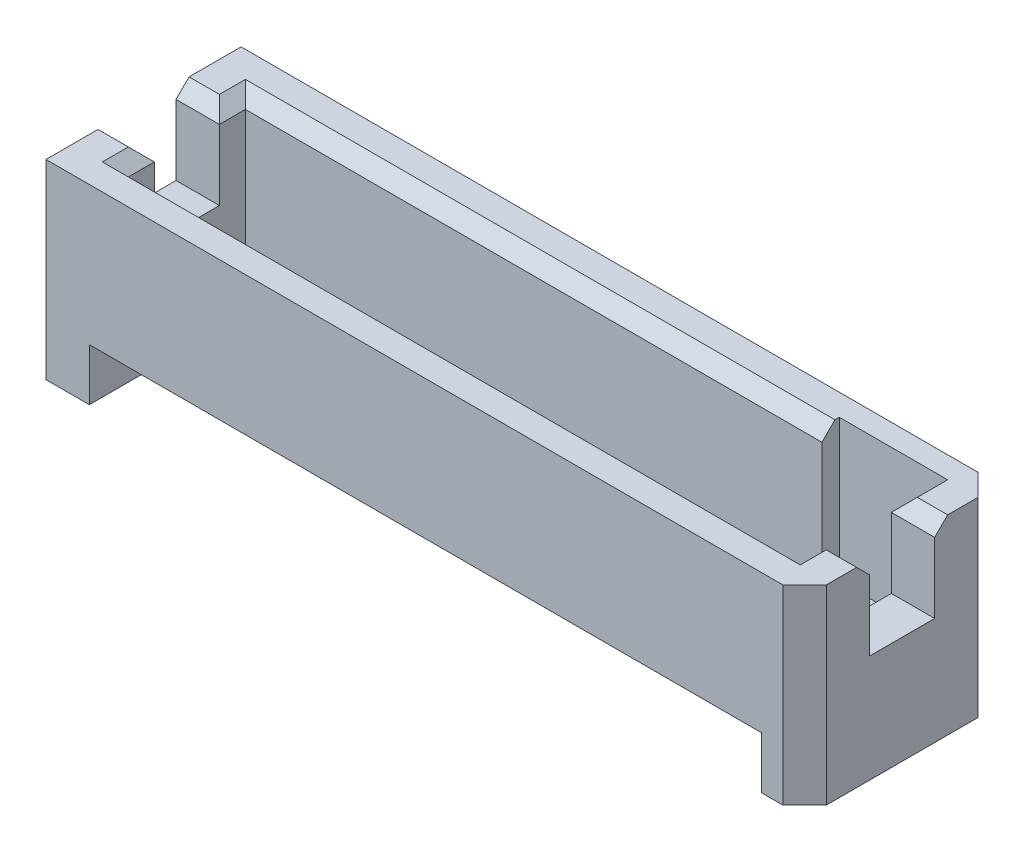
ISO-10303-21;
HEADER;
FILE_DESCRIPTION(('STEP AP214'),'2;1');
FILE_NAME('part.step','',(''),(''),'','','');
FILE_SCHEMA(('AUTOMOTIVE_DESIGN { 1 0 10303 214 1 1 1 1 }'));
ENDSEC;
DATA;
#1=APPLICATION_CONTEXT('core data for automotive mechanical design processes');
#2=APPLICATION_PROTOCOL_DEFINITION('international standard','automotive_design',2000,#1);
#3=PRODUCT_CONTEXT('',#1,'mechanical');
#4=PRODUCT('Part','Part','',(#3));
#5=PRODUCT_RELATED_PRODUCT_CATEGORY('part','',(#4));
#6=PRODUCT_DEFINITION_FORMATION('','',#4);
#7=PRODUCT_DEFINITION_CONTEXT('part definition',#1,'design');
#8=PRODUCT_DEFINITION('design','',#6,#7);
#9=PRODUCT_DEFINITION_SHAPE('','',#8);
#10=(LENGTH_UNIT() NAMED_UNIT(*) SI_UNIT(.MILLI.,.METRE.));
#11=(NAMED_UNIT(*) PLANE_ANGLE_UNIT() SI_UNIT($,.RADIAN.));
#12=(NAMED_UNIT(*) SI_UNIT($,.STERADIAN.) SOLID_ANGLE_UNIT());
#13=UNCERTAINTY_MEASURE_WITH_UNIT(LENGTH_MEASURE(1.E-05),#10,'distance_accuracy_value','');
#14=(GEOMETRIC_REPRESENTATION_CONTEXT(3) GLOBAL_UNCERTAINTY_ASSIGNED_CONTEXT((#13)) GLOBAL_UNIT_ASSIGNED_CONTEXT((#10,
#11,#12)) REPRESENTATION_CONTEXT('',''));
#15=CARTESIAN_POINT('',(0.,0.,0.));
#16=DIRECTION('',(0.,0.,1.));
#17=DIRECTION('',(1.,0.,0.));
#18=AXIS2_PLACEMENT_3D('',#15,#16,#17);
#19=CARTESIAN_POINT('',(10.4775,5.588,2.8575));
#20=DIRECTION('',(-0.707106781186546,0.,-0.707106781186549));
#21=DIRECTION('',(-0.707106781186549,0.,0.707106781186546));
#22=AXIS2_PLACEMENT_3D('',#19,#20,#21);
#23=PLANE('',#22);
#24=DIRECTION('',(0.707106781186549,0.,-0.707106781186546));
#25=VECTOR('',#24,1.);
#26=CARTESIAN_POINT('',(10.4775,0.,2.8575));
#27=LINE('',#26,#25);
#28=CARTESIAN_POINT('',(10.4775,0.,2.8575));
#29=VERTEX_POINT('',#28);
#30=CARTESIAN_POINT('',(11.1125,0.,2.2225));
#31=VERTEX_POINT('',#30);
#32=EDGE_CURVE('E11',#29,#31,#27,.T.);
#33=ORIENTED_EDGE('',*,*,#32,.T.);
#34=DIRECTION('',(0.,-1.,0.));
#35=VECTOR('',#34,1.);
#36=CARTESIAN_POINT('',(11.1125,5.588,2.2225));
#37=LINE('',#36,#35);
#38=CARTESIAN_POINT('',(11.1125,5.588,2.2225));
#39=VERTEX_POINT('',#38);
#40=EDGE_CURVE('E25',#39,#31,#37,.T.);
#41=ORIENTED_EDGE('',*,*,#40,.F.);
#42=DIRECTION('',(0.707106781186549,0.,-0.707106781186546));
#43=VECTOR('',#42,1.);
#44=CARTESIAN_POINT('',(10.4775,5.588,2.8575));
#45=LINE('',#44,#43);
#46=CARTESIAN_POINT('',(10.4775,5.588,2.8575));
#47=VERTEX_POINT('',#46);
#48=EDGE_CURVE('E661',#47,#39,#45,.T.);
#49=ORIENTED_EDGE('',*,*,#48,.F.);
#50=DIRECTION('',(0.,-1.,0.));
#51=VECTOR('',#50,1.);
#52=CARTESIAN_POINT('',(10.4775,5.588,2.8575));
#53=LINE('',#52,#51);
#54=EDGE_CURVE('E657',#47,#29,#53,.T.);
#55=ORIENTED_EDGE('',*,*,#54,.T.);
#56=EDGE_LOOP('',(#33,#41,#49,#55));
#57=FACE_BOUND('',#56,.T.);
#58=ADVANCED_FACE('F17',(#57),#23,.F.);
#59=CARTESIAN_POINT('',(-11.1125,5.588,2.8575));
#60=DIRECTION('',(0.,0.,-1.));
#61=DIRECTION('',(-1.,0.,0.));
#62=AXIS2_PLACEMENT_3D('',#59,#60,#61);
#63=PLANE('',#62);
#64=DIRECTION('',(-1.,0.,0.));
#65=VECTOR('',#64,1.);
#66=CARTESIAN_POINT('',(9.8425,1.524,2.8575));
#67=LINE('',#66,#65);
#68=CARTESIAN_POINT('',(9.8425,1.524,2.8575));
#69=VERTEX_POINT('',#68);
#70=CARTESIAN_POINT('',(-9.8425,1.524,2.8575));
#71=VERTEX_POINT('',#70);
#72=EDGE_CURVE('E652',#69,#71,#67,.T.);
#73=ORIENTED_EDGE('',*,*,#72,.F.);
#74=DIRECTION('',(0.,-1.,0.));
#75=VECTOR('',#74,1.);
#76=CARTESIAN_POINT('',(9.8425,1.524,2.8575));
#77=LINE('',#76,#75);
#78=CARTESIAN_POINT('',(9.8425,0.,2.8575));
#79=VERTEX_POINT('',#78);
#80=EDGE_CURVE('E648',#69,#79,#77,.T.);
#81=ORIENTED_EDGE('',*,*,#80,.T.);
#82=DIRECTION('',(1.,0.,0.));
#83=VECTOR('',#82,1.);
#84=CARTESIAN_POINT('',(-11.1125,0.,2.8575));
#85=LINE('',#84,#83);
#86=EDGE_CURVE('E643',#79,#29,#85,.T.);
#87=ORIENTED_EDGE('',*,*,#86,.T.);
#88=ORIENTED_EDGE('',*,*,#54,.F.);
#89=DIRECTION('',(1.,0.,0.));
#90=VECTOR('',#89,1.);
#91=CARTESIAN_POINT('',(-11.1125,5.588,2.8575));
#92=LINE('',#91,#90);
#93=CARTESIAN_POINT('',(-11.1125,5.588,2.8575));
#94=VERTEX_POINT('',#93);
#95=EDGE_CURVE('E638',#94,#47,#92,.T.);
#96=ORIENTED_EDGE('',*,*,#95,.F.);
#97=DIRECTION('',(0.,-1.,0.));
#98=VECTOR('',#97,1.);
#99=CARTESIAN_POINT('',(-11.1125,5.588,2.8575));
#100=LINE('',#99,#98);
#101=CARTESIAN_POINT('',(-11.1125,0.,2.8575));
#102=VERTEX_POINT('',#101);
#103=EDGE_CURVE('E634',#94,#102,#100,.T.);
#104=ORIENTED_EDGE('',*,*,#103,.T.);
#105=DIRECTION('',(1.,0.,0.));
#106=VECTOR('',#105,1.);
#107=CARTESIAN_POINT('',(-11.1125,0.,2.8575));
#108=LINE('',#107,#106);
#109=CARTESIAN_POINT('',(-9.8425,0.,2.8575));
#110=VERTEX_POINT('',#109);
#111=EDGE_CURVE('E630',#102,#110,#108,.T.);
#112=ORIENTED_EDGE('',*,*,#111,.T.);
#113=DIRECTION('',(0.,-1.,0.));
#114=VECTOR('',#113,1.);
#115=CARTESIAN_POINT('',(-9.8425,1.524,2.8575));
#116=LINE('',#115,#114);
#117=EDGE_CURVE('E625',#71,#110,#116,.T.);
#118=ORIENTED_EDGE('',*,*,#117,.F.);
#119=EDGE_LOOP('',(#73,#81,#87,#88,#96,#104,#112,#118));
#120=FACE_BOUND('',#119,.T.);
#121=ADVANCED_FACE('F677',(#120),#63,.F.);
#122=CARTESIAN_POINT('',(-9.8425,0.,0.));
#123=DIRECTION('',(1.,0.,0.));
#124=DIRECTION('',(0.,0.,-1.));
#125=AXIS2_PLACEMENT_3D('',#122,#123,#124);
#126=PLANE('',#125);
#127=DIRECTION('',(0.,0.496138938356834,0.868243142124459));
#128=VECTOR('',#127,1.);
#129=CARTESIAN_POINT('',(-9.8425,0.508,1.0795));
#130=LINE('',#129,#128);
#131=CARTESIAN_POINT('',(-9.8425,0.508,1.0795));
#132=VERTEX_POINT('',#131);
#133=EDGE_CURVE('E620',#132,#71,#130,.T.);
#134=ORIENTED_EDGE('',*,*,#133,.T.);
#135=ORIENTED_EDGE('',*,*,#117,.T.);
#136=DIRECTION('',(0.,0.,-1.));
#137=VECTOR('',#136,1.);
#138=CARTESIAN_POINT('',(-9.8425,0.,2.8575));
#139=LINE('',#138,#137);
#140=CARTESIAN_POINT('',(-9.8425,0.,-2.8575));
#141=VERTEX_POINT('',#140);
#142=EDGE_CURVE('E616',#110,#141,#139,.T.);
#143=ORIENTED_EDGE('',*,*,#142,.T.);
#144=DIRECTION('',(0.,1.,0.));
#145=VECTOR('',#144,1.);
#146=CARTESIAN_POINT('',(-9.8425,0.,-2.8575));
#147=LINE('',#146,#145);
#148=CARTESIAN_POINT('',(-9.8425,1.524,-2.8575));
#149=VERTEX_POINT('',#148);
#150=EDGE_CURVE('E612',#141,#149,#147,.T.);
#151=ORIENTED_EDGE('',*,*,#150,.T.);
#152=DIRECTION('',(0.,-0.496138938356834,0.868243142124459));
#153=VECTOR('',#152,1.);
#154=CARTESIAN_POINT('',(-9.8425,1.524,-2.8575));
#155=LINE('',#154,#153);
#156=CARTESIAN_POINT('',(-9.8425,0.508,-1.0795));
#157=VERTEX_POINT('',#156);
#158=EDGE_CURVE('E608',#149,#157,#155,.T.);
#159=ORIENTED_EDGE('',*,*,#158,.T.);
#160=DIRECTION('',(0.,0.,1.));
#161=VECTOR('',#160,1.);
#162=CARTESIAN_POINT('',(-9.8425,0.508,-1.0795));
#163=LINE('',#162,#161);
#164=EDGE_CURVE('E604',#157,#132,#163,.T.);
#165=ORIENTED_EDGE('',*,*,#164,.T.);
#166=EDGE_LOOP('',(#134,#135,#143,#151,#159,#165));
#167=FACE_BOUND('',#166,.T.);
#168=ADVANCED_FACE('F807',(#167),#126,.T.);
#169=CARTESIAN_POINT('',(9.8425,0.508,-1.0795));
#170=DIRECTION('',(0.,-1.,0.));
#171=DIRECTION('',(0.,0.,-1.));
#172=AXIS2_PLACEMENT_3D('',#169,#170,#171);
#173=PLANE('',#172);
#174=ORIENTED_EDGE('',*,*,#164,.F.);
#175=DIRECTION('',(-1.,0.,0.));
#176=VECTOR('',#175,1.);
#177=CARTESIAN_POINT('',(9.8425,0.508,-1.0795));
#178=LINE('',#177,#176);
#179=CARTESIAN_POINT('',(9.8425,0.508,-1.0795));
#180=VERTEX_POINT('',#179);
#181=EDGE_CURVE('E599',#180,#157,#178,.T.);
#182=ORIENTED_EDGE('',*,*,#181,.F.);
#183=DIRECTION('',(0.,0.,1.));
#184=VECTOR('',#183,1.);
#185=CARTESIAN_POINT('',(9.8425,0.508,-1.0795));
#186=LINE('',#185,#184);
#187=CARTESIAN_POINT('',(9.8425,0.508,1.0795));
#188=VERTEX_POINT('',#187);
#189=EDGE_CURVE('E595',#180,#188,#186,.T.);
#190=ORIENTED_EDGE('',*,*,#189,.T.);
#191=DIRECTION('',(-1.,0.,0.));
#192=VECTOR('',#191,1.);
#193=CARTESIAN_POINT('',(9.8425,0.508,1.0795));
#194=LINE('',#193,#192);
#195=EDGE_CURVE('E590',#188,#132,#194,.T.);
#196=ORIENTED_EDGE('',*,*,#195,.T.);
#197=EDGE_LOOP('',(#174,#182,#190,#196));
#198=FACE_BOUND('',#197,.T.);
#199=ADVANCED_FACE('F811',(#198),#173,.T.);
#200=CARTESIAN_POINT('',(9.8425,0.508,1.0795));
#201=DIRECTION('',(0.,-0.868243142124459,0.496138938356834));
#202=DIRECTION('',(0.,-0.496138938356834,-0.868243142124459));
#203=AXIS2_PLACEMENT_3D('',#200,#201,#202);
#204=PLANE('',#203);
#205=ORIENTED_EDGE('',*,*,#133,.F.);
#206=ORIENTED_EDGE('',*,*,#195,.F.);
#207=DIRECTION('',(0.,0.496138938356834,0.868243142124459));
#208=VECTOR('',#207,1.);
#209=CARTESIAN_POINT('',(9.8425,0.508,1.0795));
#210=LINE('',#209,#208);
#211=EDGE_CURVE('E585',#188,#69,#210,.T.);
#212=ORIENTED_EDGE('',*,*,#211,.T.);
#213=ORIENTED_EDGE('',*,*,#72,.T.);
#214=EDGE_LOOP('',(#205,#206,#212,#213));
#215=FACE_BOUND('',#214,.T.);
#216=ADVANCED_FACE('F817',(#215),#204,.T.);
#217=CARTESIAN_POINT('',(9.8425,0.,0.));
#218=DIRECTION('',(1.,0.,0.));
#219=DIRECTION('',(0.,0.,-1.));
#220=AXIS2_PLACEMENT_3D('',#217,#218,#219);
#221=PLANE('',#220);
#222=ORIENTED_EDGE('',*,*,#211,.F.);
#223=ORIENTED_EDGE('',*,*,#189,.F.);
#224=DIRECTION('',(0.,-0.496138938356834,0.868243142124459));
#225=VECTOR('',#224,1.);
#226=CARTESIAN_POINT('',(9.8425,1.524,-2.8575));
#227=LINE('',#226,#225);
#228=CARTESIAN_POINT('',(9.8425,1.524,-2.8575));
#229=VERTEX_POINT('',#228);
#230=EDGE_CURVE('E580',#229,#180,#227,.T.);
#231=ORIENTED_EDGE('',*,*,#230,.F.);
#232=DIRECTION('',(0.,1.,0.));
#233=VECTOR('',#232,1.);
#234=CARTESIAN_POINT('',(9.8425,0.,-2.8575));
#235=LINE('',#234,#233);
#236=CARTESIAN_POINT('',(9.8425,0.,-2.8575));
#237=VERTEX_POINT('',#236);
#238=EDGE_CURVE('E575',#237,#229,#235,.T.);
#239=ORIENTED_EDGE('',*,*,#238,.F.);
#240=DIRECTION('',(0.,0.,-1.));
#241=VECTOR('',#240,1.);
#242=CARTESIAN_POINT('',(9.8425,0.,2.8575));
#243=LINE('',#242,#241);
#244=EDGE_CURVE('E570',#79,#237,#243,.T.);
#245=ORIENTED_EDGE('',*,*,#244,.F.);
#246=ORIENTED_EDGE('',*,*,#80,.F.);
#247=EDGE_LOOP('',(#222,#223,#231,#239,#245,#246));
#248=FACE_BOUND('',#247,.T.);
#249=ADVANCED_FACE('F821',(#248),#221,.F.);
#250=CARTESIAN_POINT('',(0.,0.,0.));
#251=DIRECTION('',(0.,1.,0.));
#252=DIRECTION('',(0.,0.,1.));
#253=AXIS2_PLACEMENT_3D('',#250,#251,#252);
#254=PLANE('',#253);
#255=ORIENTED_EDGE('',*,*,#86,.F.);
#256=ORIENTED_EDGE('',*,*,#244,.T.);
#257=DIRECTION('',(-1.,0.,0.));
#258=VECTOR('',#257,1.);
#259=CARTESIAN_POINT('',(10.4775,0.,-2.8575));
#260=LINE('',#259,#258);
#261=CARTESIAN_POINT('',(10.4775,0.,-2.8575));
#262=VERTEX_POINT('',#261);
#263=EDGE_CURVE('E565',#262,#237,#260,.T.);
#264=ORIENTED_EDGE('',*,*,#263,.F.);
#265=DIRECTION('',(-0.707106781186549,0.,-0.707106781186546));
#266=VECTOR('',#265,1.);
#267=CARTESIAN_POINT('',(11.1125,0.,-2.2225));
#268=LINE('',#267,#266);
#269=CARTESIAN_POINT('',(11.1125,0.,-2.2225));
#270=VERTEX_POINT('',#269);
#271=EDGE_CURVE('E560',#270,#262,#268,.T.);
#272=ORIENTED_EDGE('',*,*,#271,.F.);
#273=DIRECTION('',(0.,0.,-1.));
#274=VECTOR('',#273,1.);
#275=CARTESIAN_POINT('',(11.1125,0.,2.2225));
#276=LINE('',#275,#274);
#277=EDGE_CURVE('E555',#31,#270,#276,.T.);
#278=ORIENTED_EDGE('',*,*,#277,.F.);
#279=ORIENTED_EDGE('',*,*,#32,.F.);
#280=EDGE_LOOP('',(#255,#256,#264,#272,#278,#279));
#281=FACE_BOUND('',#280,.T.);
#282=ADVANCED_FACE('F682',(#281),#254,.F.);
#283=CARTESIAN_POINT('',(11.1125,5.588,2.2225));
#284=DIRECTION('',(-1.,0.,0.));
#285=DIRECTION('',(0.,0.,1.));
#286=AXIS2_PLACEMENT_3D('',#283,#284,#285);
#287=PLANE('',#286);
#288=DIRECTION('',(0.,-0.707106781186548,-0.707106781186547));
#289=VECTOR('',#288,1.);
#290=CARTESIAN_POINT('',(11.1125,5.588,1.3335));
#291=LINE('',#290,#289);
#292=CARTESIAN_POINT('',(11.1125,5.588,1.3335));
#293=VERTEX_POINT('',#292);
#294=CARTESIAN_POINT('',(11.1125,5.207,0.9525));
#295=VERTEX_POINT('',#294);
#296=EDGE_CURVE('E550',#293,#295,#291,.T.);
#297=ORIENTED_EDGE('',*,*,#296,.F.);
#298=DIRECTION('',(0.,0.,-1.));
#299=VECTOR('',#298,1.);
#300=CARTESIAN_POINT('',(11.1125,5.588,2.2225));
#301=LINE('',#300,#299);
#302=EDGE_CURVE('E545',#39,#293,#301,.T.);
#303=ORIENTED_EDGE('',*,*,#302,.F.);
#304=ORIENTED_EDGE('',*,*,#40,.T.);
#305=ORIENTED_EDGE('',*,*,#277,.T.);
#306=DIRECTION('',(0.,-1.,0.));
#307=VECTOR('',#306,1.);
#308=CARTESIAN_POINT('',(11.1125,5.588,-2.2225));
#309=LINE('',#308,#307);
#310=CARTESIAN_POINT('',(11.1125,5.588,-2.2225));
#311=VERTEX_POINT('',#310);
#312=EDGE_CURVE('E540',#311,#270,#309,.T.);
#313=ORIENTED_EDGE('',*,*,#312,.F.);
#314=DIRECTION('',(0.,0.,-1.));
#315=VECTOR('',#314,1.);
#316=CARTESIAN_POINT('',(11.1125,5.588,2.2225));
#317=LINE('',#316,#315);
#318=CARTESIAN_POINT('',(11.1125,5.588,-1.3335));
#319=VERTEX_POINT('',#318);
#320=EDGE_CURVE('E535',#319,#311,#317,.T.);
#321=ORIENTED_EDGE('',*,*,#320,.F.);
#322=DIRECTION('',(0.,0.707106781186548,-0.707106781186547));
#323=VECTOR('',#322,1.);
#324=CARTESIAN_POINT('',(11.1125,5.207,-0.9525));
#325=LINE('',#324,#323);
#326=CARTESIAN_POINT('',(11.1125,5.207,-0.9525));
#327=VERTEX_POINT('',#326);
#328=EDGE_CURVE('E530',#327,#319,#325,.T.);
#329=ORIENTED_EDGE('',*,*,#328,.F.);
#330=DIRECTION('',(0.,-1.,0.));
#331=VECTOR('',#330,1.);
#332=CARTESIAN_POINT('',(11.1125,8.0264,-0.9525));
#333=LINE('',#332,#331);
#334=CARTESIAN_POINT('',(11.1125,3.1496,-0.9525));
#335=VERTEX_POINT('',#334);
#336=EDGE_CURVE('E526',#327,#335,#333,.T.);
#337=ORIENTED_EDGE('',*,*,#336,.T.);
#338=DIRECTION('',(0.,0.,-1.));
#339=VECTOR('',#338,1.);
#340=CARTESIAN_POINT('',(11.1125,3.1496,0.9525));
#341=LINE('',#340,#339);
#342=CARTESIAN_POINT('',(11.1125,3.1496,0.9525));
#343=VERTEX_POINT('',#342);
#344=EDGE_CURVE('E521',#343,#335,#341,.T.);
#345=ORIENTED_EDGE('',*,*,#344,.F.);
#346=DIRECTION('',(0.,-1.,0.));
#347=VECTOR('',#346,1.);
#348=CARTESIAN_POINT('',(11.1125,8.0264,0.9525));
#349=LINE('',#348,#347);
#350=EDGE_CURVE('E516',#295,#343,#349,.T.);
#351=ORIENTED_EDGE('',*,*,#350,.F.);
#352=EDGE_LOOP('',(#297,#303,#304,#305,#313,#321,#329,#337,#345,#351));
#353=FACE_BOUND('',#352,.T.);
#354=ADVANCED_FACE('F671',(#353),#287,.F.);
#355=CARTESIAN_POINT('',(-11.1125,8.0264,0.9525));
#356=DIRECTION('',(0.,0.,-1.));
#357=DIRECTION('',(-1.,0.,0.));
#358=AXIS2_PLACEMENT_3D('',#355,#356,#357);
#359=PLANE('',#358);
#360=DIRECTION('',(0.,-1.,0.));
#361=VECTOR('',#360,1.);
#362=CARTESIAN_POINT('',(9.8425,8.0264,0.9525));
#363=LINE('',#362,#361);
#364=CARTESIAN_POINT('',(9.8425,5.207,0.9525));
#365=VERTEX_POINT('',#364);
#366=CARTESIAN_POINT('',(9.8425,3.1496,0.9525));
#367=VERTEX_POINT('',#366);
#368=EDGE_CURVE('E511',#365,#367,#363,.T.);
#369=ORIENTED_EDGE('',*,*,#368,.F.);
#370=DIRECTION('',(-1.,0.,0.));
#371=VECTOR('',#370,1.);
#372=CARTESIAN_POINT('',(11.1125,5.207,0.9525));
#373=LINE('',#372,#371);
#374=EDGE_CURVE('E506',#295,#365,#373,.T.);
#375=ORIENTED_EDGE('',*,*,#374,.F.);
#376=ORIENTED_EDGE('',*,*,#350,.T.);
#377=DIRECTION('',(1.,0.,0.));
#378=VECTOR('',#377,1.);
#379=CARTESIAN_POINT('',(-11.1125,3.1496,0.9525));
#380=LINE('',#379,#378);
#381=EDGE_CURVE('E501',#367,#343,#380,.T.);
#382=ORIENTED_EDGE('',*,*,#381,.F.);
#383=EDGE_LOOP('',(#369,#375,#376,#382));
#384=FACE_BOUND('',#383,.T.);
#385=ADVANCED_FACE('F791',(#384),#359,.T.);
#386=CARTESIAN_POINT('',(0.,3.1496,0.));
#387=DIRECTION('',(0.,1.,0.));
#388=DIRECTION('',(0.,0.,1.));
#389=AXIS2_PLACEMENT_3D('',#386,#387,#388);
#390=PLANE('',#389);
#391=DIRECTION('',(0.,0.,-1.));
#392=VECTOR('',#391,1.);
#393=CARTESIAN_POINT('',(9.8425,3.1496,0.));
#394=LINE('',#393,#392);
#395=CARTESIAN_POINT('',(9.8425,3.1496,-0.9525));
#396=VERTEX_POINT('',#395);
#397=EDGE_CURVE('E496',#367,#396,#394,.T.);
#398=ORIENTED_EDGE('',*,*,#397,.F.);
#399=ORIENTED_EDGE('',*,*,#381,.T.);
#400=ORIENTED_EDGE('',*,*,#344,.T.);
#401=DIRECTION('',(-1.,0.,0.));
#402=VECTOR('',#401,1.);
#403=CARTESIAN_POINT('',(11.1125,3.1496,-0.9525));
#404=LINE('',#403,#402);
#405=EDGE_CURVE('E492',#335,#396,#404,.T.);
#406=ORIENTED_EDGE('',*,*,#405,.T.);
#407=EDGE_LOOP('',(#398,#399,#400,#406));
#408=FACE_BOUND('',#407,.T.);
#409=ADVANCED_FACE('F793',(#408),#390,.T.);
#410=CARTESIAN_POINT('',(11.1125,8.0264,-0.9525));
#411=DIRECTION('',(0.,0.,1.));
#412=DIRECTION('',(1.,0.,0.));
#413=AXIS2_PLACEMENT_3D('',#410,#411,#412);
#414=PLANE('',#413);
#415=ORIENTED_EDGE('',*,*,#336,.F.);
#416=DIRECTION('',(-1.,0.,0.));
#417=VECTOR('',#416,1.);
#418=CARTESIAN_POINT('',(11.1125,5.207,-0.9525));
#419=LINE('',#418,#417);
#420=CARTESIAN_POINT('',(9.8425,5.207,-0.9525));
#421=VERTEX_POINT('',#420);
#422=EDGE_CURVE('E488',#327,#421,#419,.T.);
#423=ORIENTED_EDGE('',*,*,#422,.T.);
#424=DIRECTION('',(0.,1.,0.));
#425=VECTOR('',#424,1.);
#426=CARTESIAN_POINT('',(9.8425,8.0264,-0.9525));
#427=LINE('',#426,#425);
#428=EDGE_CURVE('E483',#396,#421,#427,.T.);
#429=ORIENTED_EDGE('',*,*,#428,.F.);
#430=ORIENTED_EDGE('',*,*,#405,.F.);
#431=EDGE_LOOP('',(#415,#423,#429,#430));
#432=FACE_BOUND('',#431,.T.);
#433=ADVANCED_FACE('F698',(#432),#414,.T.);
#434=CARTESIAN_POINT('',(9.8425,1.4351,1.7145));
#435=DIRECTION('',(1.,0.,0.));
#436=DIRECTION('',(0.,0.,-1.));
#437=AXIS2_PLACEMENT_3D('',#434,#435,#436);
#438=PLANE('',#437);
#439=ORIENTED_EDGE('',*,*,#397,.T.);
#440=ORIENTED_EDGE('',*,*,#428,.T.);
#441=DIRECTION('',(0.,0.,-1.));
#442=VECTOR('',#441,1.);
#443=CARTESIAN_POINT('',(9.8425,5.207,1.7145));
#444=LINE('',#443,#442);
#445=CARTESIAN_POINT('',(9.8425,5.207,-2.2225));
#446=VERTEX_POINT('',#445);
#447=EDGE_CURVE('E479',#421,#446,#444,.T.);
#448=ORIENTED_EDGE('',*,*,#447,.T.);
#449=DIRECTION('',(0.,1.,0.));
#450=VECTOR('',#449,1.);
#451=CARTESIAN_POINT('',(9.8425,1.4351,-2.2225));
#452=LINE('',#451,#450);
#453=CARTESIAN_POINT('',(9.8425,1.4351,-2.2225));
#454=VERTEX_POINT('',#453);
#455=EDGE_CURVE('E475',#454,#446,#452,.T.);
#456=ORIENTED_EDGE('',*,*,#455,.F.);
#457=DIRECTION('',(0.,0.,-1.));
#458=VECTOR('',#457,1.);
#459=CARTESIAN_POINT('',(9.8425,1.4351,1.7145));
#460=LINE('',#459,#458);
#461=CARTESIAN_POINT('',(9.8425,1.4351,1.7145));
#462=VERTEX_POINT('',#461);
#463=EDGE_CURVE('E233',#462,#454,#460,.T.);
#464=ORIENTED_EDGE('',*,*,#463,.F.);
#465=DIRECTION('',(0.,1.,0.));
#466=VECTOR('',#465,1.);
#467=CARTESIAN_POINT('',(9.8425,1.4351,1.7145));
#468=LINE('',#467,#466);
#469=CARTESIAN_POINT('',(9.8425,5.207,1.7145));
#470=VERTEX_POINT('',#469);
#471=EDGE_CURVE('E468',#462,#470,#468,.T.);
#472=ORIENTED_EDGE('',*,*,#471,.T.);
#473=DIRECTION('',(0.,0.,-1.));
#474=VECTOR('',#473,1.);
#475=CARTESIAN_POINT('',(9.8425,5.207,1.7145));
#476=LINE('',#475,#474);
#477=EDGE_CURVE('E463',#470,#365,#476,.T.);
#478=ORIENTED_EDGE('',*,*,#477,.T.);
#479=ORIENTED_EDGE('',*,*,#368,.T.);
#480=EDGE_LOOP('',(#439,#440,#448,#456,#464,#472,#478,#479));
#481=FACE_BOUND('',#480,.T.);
#482=ADVANCED_FACE('F702',(#481),#438,.F.);
#483=CARTESIAN_POINT('',(9.8425,5.207,1.7145));
#484=DIRECTION('',(-0.707106781186548,0.707106781186548,0.));
#485=DIRECTION('',(-0.707106781186548,-0.707106781186548,0.));
#486=AXIS2_PLACEMENT_3D('',#483,#484,#485);
#487=PLANE('',#486);
#488=DIRECTION('',(0.,0.,-1.));
#489=VECTOR('',#488,1.);
#490=CARTESIAN_POINT('',(10.2235,5.588,1.7145));
#491=LINE('',#490,#489);
#492=CARTESIAN_POINT('',(10.2235,5.588,2.0955));
#493=VERTEX_POINT('',#492);
#494=CARTESIAN_POINT('',(10.2235,5.588,1.3335));
#495=VERTEX_POINT('',#494);
#496=EDGE_CURVE('E459',#493,#495,#491,.T.);
#497=ORIENTED_EDGE('',*,*,#496,.T.);
#498=DIRECTION('',(-0.577350269189626,-0.577350269189626,-0.577350269189625));
#499=VECTOR('',#498,1.);
#500=CARTESIAN_POINT('',(10.0965,5.461,1.2065));
#501=LINE('',#500,#499);
#502=EDGE_CURVE('E454',#495,#365,#501,.T.);
#503=ORIENTED_EDGE('',*,*,#502,.T.);
#504=ORIENTED_EDGE('',*,*,#477,.F.);
#505=DIRECTION('',(-0.577350269189626,-0.577350269189626,-0.577350269189626));
#506=VECTOR('',#505,1.);
#507=CARTESIAN_POINT('',(9.8425,5.207,1.7145));
#508=LINE('',#507,#506);
#509=EDGE_CURVE('E449',#493,#470,#508,.T.);
#510=ORIENTED_EDGE('',*,*,#509,.F.);
#511=EDGE_LOOP('',(#497,#503,#504,#510));
#512=FACE_BOUND('',#511,.T.);
#513=ADVANCED_FACE('F788',(#512),#487,.T.);
#514=CARTESIAN_POINT('',(-9.8425,5.207,1.7145));
#515=DIRECTION('',(0.,0.707106781186548,-0.707106781186548));
#516=DIRECTION('',(0.,0.707106781186548,0.707106781186548));
#517=AXIS2_PLACEMENT_3D('',#514,#515,#516);
#518=PLANE('',#517);
#519=DIRECTION('',(1.,0.,0.));
#520=VECTOR('',#519,1.);
#521=CARTESIAN_POINT('',(-9.8425,5.207,1.7145));
#522=LINE('',#521,#520);
#523=CARTESIAN_POINT('',(-9.8425,5.207,1.7145));
#524=VERTEX_POINT('',#523);
#525=EDGE_CURVE('E444',#524,#470,#522,.T.);
#526=ORIENTED_EDGE('',*,*,#525,.F.);
#527=DIRECTION('',(0.577350269189626,-0.577350269189626,-0.577350269189626));
#528=VECTOR('',#527,1.);
#529=CARTESIAN_POINT('',(-9.8425,5.207,1.7145));
#530=LINE('',#529,#528);
#531=CARTESIAN_POINT('',(-10.2235,5.588,2.0955));
#532=VERTEX_POINT('',#531);
#533=EDGE_CURVE('E439',#532,#524,#530,.T.);
#534=ORIENTED_EDGE('',*,*,#533,.F.);
#535=DIRECTION('',(1.,0.,0.));
#536=VECTOR('',#535,1.);
#537=CARTESIAN_POINT('',(-9.8425,5.588,2.0955));
#538=LINE('',#537,#536);
#539=EDGE_CURVE('E434',#532,#493,#538,.T.);
#540=ORIENTED_EDGE('',*,*,#539,.T.);
#541=ORIENTED_EDGE('',*,*,#509,.T.);
#542=EDGE_LOOP('',(#526,#534,#540,#541));
#543=FACE_BOUND('',#542,.T.);
#544=ADVANCED_FACE('F714',(#543),#518,.T.);
#545=CARTESIAN_POINT('',(0.,5.588,0.));
#546=DIRECTION('',(0.,1.,0.));
#547=DIRECTION('',(0.,0.,1.));
#548=AXIS2_PLACEMENT_3D('',#545,#546,#547);
#549=PLANE('',#548);
#550=ORIENTED_EDGE('',*,*,#302,.T.);
#551=DIRECTION('',(-1.,0.,0.));
#552=VECTOR('',#551,1.);
#553=CARTESIAN_POINT('',(11.1125,5.588,1.3335));
#554=LINE('',#553,#552);
#555=EDGE_CURVE('E429',#293,#495,#554,.T.);
#556=ORIENTED_EDGE('',*,*,#555,.T.);
#557=ORIENTED_EDGE('',*,*,#496,.F.);
#558=ORIENTED_EDGE('',*,*,#539,.F.);
#559=DIRECTION('',(0.,0.,1.));
#560=VECTOR('',#559,1.);
#561=CARTESIAN_POINT('',(-10.2235,5.588,-1.7145));
#562=LINE('',#561,#560);
#563=CARTESIAN_POINT('',(-10.2235,5.588,1.3335));
#564=VERTEX_POINT('',#563);
#565=EDGE_CURVE('E424',#564,#532,#562,.T.);
#566=ORIENTED_EDGE('',*,*,#565,.F.);
#567=DIRECTION('',(-1.,0.,0.));
#568=VECTOR('',#567,1.);
#569=CARTESIAN_POINT('',(11.1125,5.588,1.3335));
#570=LINE('',#569,#568);
#571=CARTESIAN_POINT('',(-11.1125,5.588,1.3335));
#572=VERTEX_POINT('',#571);
#573=EDGE_CURVE('E420',#564,#572,#570,.T.);
#574=ORIENTED_EDGE('',*,*,#573,.T.);
#575=DIRECTION('',(0.,0.,1.));
#576=VECTOR('',#575,1.);
#577=CARTESIAN_POINT('',(-11.1125,5.588,-2.8575));
#578=LINE('',#577,#576);
#579=EDGE_CURVE('E415',#572,#94,#578,.T.);
#580=ORIENTED_EDGE('',*,*,#579,.T.);
#581=ORIENTED_EDGE('',*,*,#95,.T.);
#582=ORIENTED_EDGE('',*,*,#48,.T.);
#583=EDGE_LOOP('',(#550,#556,#557,#558,#566,#574,#580,#581,#582));
#584=FACE_BOUND('',#583,.T.);
#585=ADVANCED_FACE('F674',(#584),#549,.T.);
#586=CARTESIAN_POINT('',(-11.1125,5.588,-2.8575));
#587=DIRECTION('',(1.,0.,0.));
#588=DIRECTION('',(0.,0.,-1.));
#589=AXIS2_PLACEMENT_3D('',#586,#587,#588);
#590=PLANE('',#589);
#591=DIRECTION('',(0.,-0.707106781186548,-0.707106781186547));
#592=VECTOR('',#591,1.);
#593=CARTESIAN_POINT('',(-11.1125,5.588,1.3335));
#594=LINE('',#593,#592);
#595=CARTESIAN_POINT('',(-11.1125,5.207,0.9525));
#596=VERTEX_POINT('',#595);
#597=EDGE_CURVE('E411',#572,#596,#594,.T.);
#598=ORIENTED_EDGE('',*,*,#597,.T.);
#599=DIRECTION('',(0.,-1.,0.));
#600=VECTOR('',#599,1.);
#601=CARTESIAN_POINT('',(-11.1125,8.0264,0.9525));
#602=LINE('',#601,#600);
#603=CARTESIAN_POINT('',(-11.1125,3.1496,0.9525));
#604=VERTEX_POINT('',#603);
#605=EDGE_CURVE('E407',#596,#604,#602,.T.);
#606=ORIENTED_EDGE('',*,*,#605,.T.);
#607=DIRECTION('',(0.,0.,1.));
#608=VECTOR('',#607,1.);
#609=CARTESIAN_POINT('',(-11.1125,3.1496,-0.9525));
#610=LINE('',#609,#608);
#611=CARTESIAN_POINT('',(-11.1125,3.1496,-0.9525));
#612=VERTEX_POINT('',#611);
#613=EDGE_CURVE('E402',#612,#604,#610,.T.);
#614=ORIENTED_EDGE('',*,*,#613,.F.);
#615=DIRECTION('',(0.,-1.,0.));
#616=VECTOR('',#615,1.);
#617=CARTESIAN_POINT('',(-11.1125,8.0264,-0.9525));
#618=LINE('',#617,#616);
#619=CARTESIAN_POINT('',(-11.1125,5.207,-0.9525));
#620=VERTEX_POINT('',#619);
#621=EDGE_CURVE('E397',#620,#612,#618,.T.);
#622=ORIENTED_EDGE('',*,*,#621,.F.);
#623=DIRECTION('',(0.,0.707106781186548,-0.707106781186547));
#624=VECTOR('',#623,1.);
#625=CARTESIAN_POINT('',(-11.1125,5.207,-0.9525));
#626=LINE('',#625,#624);
#627=CARTESIAN_POINT('',(-11.1125,5.588,-1.3335));
#628=VERTEX_POINT('',#627);
#629=EDGE_CURVE('E393',#620,#628,#626,.T.);
#630=ORIENTED_EDGE('',*,*,#629,.T.);
#631=DIRECTION('',(0.,0.,1.));
#632=VECTOR('',#631,1.);
#633=CARTESIAN_POINT('',(-11.1125,5.588,-2.8575));
#634=LINE('',#633,#632);
#635=CARTESIAN_POINT('',(-11.1125,5.588,-2.8575));
#636=VERTEX_POINT('',#635);
#637=EDGE_CURVE('E388',#636,#628,#634,.T.);
#638=ORIENTED_EDGE('',*,*,#637,.F.);
#639=DIRECTION('',(0.,-1.,0.));
#640=VECTOR('',#639,1.);
#641=CARTESIAN_POINT('',(-11.1125,5.588,-2.8575));
#642=LINE('',#641,#640);
#643=CARTESIAN_POINT('',(-11.1125,0.,-2.8575));
#644=VERTEX_POINT('',#643);
#645=EDGE_CURVE('E384',#636,#644,#642,.T.);
#646=ORIENTED_EDGE('',*,*,#645,.T.);
#647=DIRECTION('',(0.,0.,1.));
#648=VECTOR('',#647,1.);
#649=CARTESIAN_POINT('',(-11.1125,0.,-2.8575));
#650=LINE('',#649,#648);
#651=EDGE_CURVE('E379',#644,#102,#650,.T.);
#652=ORIENTED_EDGE('',*,*,#651,.T.);
#653=ORIENTED_EDGE('',*,*,#103,.F.);
#654=ORIENTED_EDGE('',*,*,#579,.F.);
#655=EDGE_LOOP('',(#598,#606,#614,#622,#630,#638,#646,#652,#653,#654));
#656=FACE_BOUND('',#655,.T.);
#657=ADVANCED_FACE('F782',(#656),#590,.F.);
#658=CARTESIAN_POINT('',(0.,0.,0.));
#659=DIRECTION('',(0.,1.,0.));
#660=DIRECTION('',(0.,0.,1.));
#661=AXIS2_PLACEMENT_3D('',#658,#659,#660);
#662=PLANE('',#661);
#663=ORIENTED_EDGE('',*,*,#142,.F.);
#664=ORIENTED_EDGE('',*,*,#111,.F.);
#665=ORIENTED_EDGE('',*,*,#651,.F.);
#666=DIRECTION('',(-1.,0.,0.));
#667=VECTOR('',#666,1.);
#668=CARTESIAN_POINT('',(10.4775,0.,-2.8575));
#669=LINE('',#668,#667);
#670=EDGE_CURVE('E374',#141,#644,#669,.T.);
#671=ORIENTED_EDGE('',*,*,#670,.F.);
#672=EDGE_LOOP('',(#663,#664,#665,#671));
#673=FACE_BOUND('',#672,.T.);
#674=ADVANCED_FACE('F892',(#673),#662,.F.);
#675=CARTESIAN_POINT('',(10.4775,5.588,-2.8575));
#676=DIRECTION('',(0.,0.,1.));
#677=DIRECTION('',(1.,0.,0.));
#678=AXIS2_PLACEMENT_3D('',#675,#676,#677);
#679=PLANE('',#678);
#680=ORIENTED_EDGE('',*,*,#263,.T.);
#681=ORIENTED_EDGE('',*,*,#238,.T.);
#682=DIRECTION('',(-1.,0.,0.));
#683=VECTOR('',#682,1.);
#684=CARTESIAN_POINT('',(9.8425,1.524,-2.8575));
#685=LINE('',#684,#683);
#686=EDGE_CURVE('E369',#229,#149,#685,.T.);
#687=ORIENTED_EDGE('',*,*,#686,.T.);
#688=ORIENTED_EDGE('',*,*,#150,.F.);
#689=ORIENTED_EDGE('',*,*,#670,.T.);
#690=ORIENTED_EDGE('',*,*,#645,.F.);
#691=DIRECTION('',(-1.,0.,0.));
#692=VECTOR('',#691,1.);
#693=CARTESIAN_POINT('',(10.4775,5.588,-2.8575));
#694=LINE('',#693,#692);
#695=CARTESIAN_POINT('',(10.4775,5.588,-2.8575));
#696=VERTEX_POINT('',#695);
#697=EDGE_CURVE('E364',#696,#636,#694,.T.);
#698=ORIENTED_EDGE('',*,*,#697,.F.);
#699=DIRECTION('',(0.,-1.,0.));
#700=VECTOR('',#699,1.);
#701=CARTESIAN_POINT('',(10.4775,5.588,-2.8575));
#702=LINE('',#701,#700);
#703=EDGE_CURVE('E359',#696,#262,#702,.T.);
#704=ORIENTED_EDGE('',*,*,#703,.T.);
#705=EDGE_LOOP('',(#680,#681,#687,#688,#689,#690,#698,#704));
#706=FACE_BOUND('',#705,.T.);
#707=ADVANCED_FACE('F901',(#706),#679,.F.);
#708=CARTESIAN_POINT('',(11.1125,5.588,-2.2225));
#709=DIRECTION('',(-0.707106781186546,0.,0.707106781186549));
#710=DIRECTION('',(0.707106781186549,0.,0.707106781186546));
#711=AXIS2_PLACEMENT_3D('',#708,#709,#710);
#712=PLANE('',#711);
#713=ORIENTED_EDGE('',*,*,#271,.T.);
#714=ORIENTED_EDGE('',*,*,#703,.F.);
#715=DIRECTION('',(-0.707106781186549,0.,-0.707106781186546));
#716=VECTOR('',#715,1.);
#717=CARTESIAN_POINT('',(11.1125,5.588,-2.2225));
#718=LINE('',#717,#716);
#719=EDGE_CURVE('E354',#311,#696,#718,.T.);
#720=ORIENTED_EDGE('',*,*,#719,.F.);
#721=ORIENTED_EDGE('',*,*,#312,.T.);
#722=EDGE_LOOP('',(#713,#714,#720,#721));
#723=FACE_BOUND('',#722,.T.);
#724=ADVANCED_FACE('F685',(#723),#712,.F.);
#725=CARTESIAN_POINT('',(0.,5.588,0.));
#726=DIRECTION('',(0.,1.,0.));
#727=DIRECTION('',(0.,0.,1.));
#728=AXIS2_PLACEMENT_3D('',#725,#726,#727);
#729=PLANE('',#728);
#730=DIRECTION('',(0.,0.,1.));
#731=VECTOR('',#730,1.);
#732=CARTESIAN_POINT('',(7.0485,5.588,-2.2225));
#733=LINE('',#732,#731);
#734=CARTESIAN_POINT('',(7.0485,5.588,-2.2225));
#735=VERTEX_POINT('',#734);
#736=CARTESIAN_POINT('',(7.0485,5.588,-2.0955));
#737=VERTEX_POINT('',#736);
#738=EDGE_CURVE('E350',#735,#737,#733,.T.);
#739=ORIENTED_EDGE('',*,*,#738,.F.);
#740=DIRECTION('',(-1.,0.,0.));
#741=VECTOR('',#740,1.);
#742=CARTESIAN_POINT('',(10.2235,5.588,-2.2225));
#743=LINE('',#742,#741);
#744=CARTESIAN_POINT('',(10.2235,5.588,-2.2225));
#745=VERTEX_POINT('',#744);
#746=EDGE_CURVE('E252',#745,#735,#743,.T.);
#747=ORIENTED_EDGE('',*,*,#746,.F.);
#748=DIRECTION('',(0.,0.,-1.));
#749=VECTOR('',#748,1.);
#750=CARTESIAN_POINT('',(10.2235,5.588,1.7145));
#751=LINE('',#750,#749);
#752=CARTESIAN_POINT('',(10.2235,5.588,-1.3335));
#753=VERTEX_POINT('',#752);
#754=EDGE_CURVE('E342',#753,#745,#751,.T.);
#755=ORIENTED_EDGE('',*,*,#754,.F.);
#756=DIRECTION('',(-1.,0.,0.));
#757=VECTOR('',#756,1.);
#758=CARTESIAN_POINT('',(11.1125,5.588,-1.3335));
#759=LINE('',#758,#757);
#760=EDGE_CURVE('E337',#319,#753,#759,.T.);
#761=ORIENTED_EDGE('',*,*,#760,.F.);
#762=ORIENTED_EDGE('',*,*,#320,.T.);
#763=ORIENTED_EDGE('',*,*,#719,.T.);
#764=ORIENTED_EDGE('',*,*,#697,.T.);
#765=ORIENTED_EDGE('',*,*,#637,.T.);
#766=DIRECTION('',(-1.,0.,0.));
#767=VECTOR('',#766,1.);
#768=CARTESIAN_POINT('',(11.1125,5.588,-1.3335));
#769=LINE('',#768,#767);
#770=CARTESIAN_POINT('',(-10.2235,5.588,-1.3335));
#771=VERTEX_POINT('',#770);
#772=EDGE_CURVE('E332',#771,#628,#769,.T.);
#773=ORIENTED_EDGE('',*,*,#772,.F.);
#774=DIRECTION('',(0.,0.,1.));
#775=VECTOR('',#774,1.);
#776=CARTESIAN_POINT('',(-10.2235,5.588,-1.7145));
#777=LINE('',#776,#775);
#778=CARTESIAN_POINT('',(-10.2235,5.588,-2.0955));
#779=VERTEX_POINT('',#778);
#780=EDGE_CURVE('E327',#779,#771,#777,.T.);
#781=ORIENTED_EDGE('',*,*,#780,.F.);
#782=DIRECTION('',(-1.,0.,0.));
#783=VECTOR('',#782,1.);
#784=CARTESIAN_POINT('',(9.8425,5.588,-2.0955));
#785=LINE('',#784,#783);
#786=EDGE_CURVE('E322',#737,#779,#785,.T.);
#787=ORIENTED_EDGE('',*,*,#786,.F.);
#788=EDGE_LOOP('',(#739,#747,#755,#761,#762,#763,#764,#765,#773,#781,#787));
#789=FACE_BOUND('',#788,.T.);
#790=ADVANCED_FACE('F690',(#789),#729,.T.);
#791=CARTESIAN_POINT('',(9.8425,5.207,-1.7145));
#792=DIRECTION('',(0.,0.707106781186548,0.707106781186548));
#793=DIRECTION('',(0.,-0.707106781186548,0.707106781186548));
#794=AXIS2_PLACEMENT_3D('',#791,#792,#793);
#795=PLANE('',#794);
#796=DIRECTION('',(0.,-0.707106781186548,0.707106781186547));
#797=VECTOR('',#796,1.);
#798=CARTESIAN_POINT('',(7.0485,5.207,-1.7145));
#799=LINE('',#798,#797);
#800=CARTESIAN_POINT('',(7.0485,5.207,-1.7145));
#801=VERTEX_POINT('',#800);
#802=EDGE_CURVE('E318',#737,#801,#799,.T.);
#803=ORIENTED_EDGE('',*,*,#802,.F.);
#804=ORIENTED_EDGE('',*,*,#786,.T.);
#805=DIRECTION('',(0.577350269189626,-0.577350269189626,0.577350269189626));
#806=VECTOR('',#805,1.);
#807=CARTESIAN_POINT('',(-9.8425,5.207,-1.7145));
#808=LINE('',#807,#806);
#809=CARTESIAN_POINT('',(-9.8425,5.207,-1.7145));
#810=VERTEX_POINT('',#809);
#811=EDGE_CURVE('E314',#779,#810,#808,.T.);
#812=ORIENTED_EDGE('',*,*,#811,.T.);
#813=DIRECTION('',(-1.,0.,0.));
#814=VECTOR('',#813,1.);
#815=CARTESIAN_POINT('',(9.8425,5.207,-1.7145));
#816=LINE('',#815,#814);
#817=EDGE_CURVE('E309',#801,#810,#816,.T.);
#818=ORIENTED_EDGE('',*,*,#817,.F.);
#819=EDGE_LOOP('',(#803,#804,#812,#818));
#820=FACE_BOUND('',#819,.T.);
#821=ADVANCED_FACE('F928',(#820),#795,.T.);
#822=CARTESIAN_POINT('',(9.8425,1.4351,-1.7145));
#823=DIRECTION('',(0.,0.,-1.));
#824=DIRECTION('',(-1.,0.,0.));
#825=AXIS2_PLACEMENT_3D('',#822,#823,#824);
#826=PLANE('',#825);
#827=DIRECTION('',(-1.,0.,0.));
#828=VECTOR('',#827,1.);
#829=CARTESIAN_POINT('',(9.8425,1.4351,-1.7145));
#830=LINE('',#829,#828);
#831=CARTESIAN_POINT('',(7.0485,1.4351,-1.7145));
#832=VERTEX_POINT('',#831);
#833=CARTESIAN_POINT('',(-9.8425,1.4351,-1.7145));
#834=VERTEX_POINT('',#833);
#835=EDGE_CURVE('E305',#832,#834,#830,.T.);
#836=ORIENTED_EDGE('',*,*,#835,.F.);
#837=DIRECTION('',(0.,1.,0.));
#838=VECTOR('',#837,1.);
#839=CARTESIAN_POINT('',(7.0485,1.4351,-1.7145));
#840=LINE('',#839,#838);
#841=EDGE_CURVE('E247',#832,#801,#840,.T.);
#842=ORIENTED_EDGE('',*,*,#841,.T.);
#843=ORIENTED_EDGE('',*,*,#817,.T.);
#844=DIRECTION('',(0.,1.,0.));
#845=VECTOR('',#844,1.);
#846=CARTESIAN_POINT('',(-9.8425,1.4351,-1.7145));
#847=LINE('',#846,#845);
#848=EDGE_CURVE('E297',#834,#810,#847,.T.);
#849=ORIENTED_EDGE('',*,*,#848,.F.);
#850=EDGE_LOOP('',(#836,#842,#843,#849));
#851=FACE_BOUND('',#850,.T.);
#852=ADVANCED_FACE('F937',(#851),#826,.F.);
#853=CARTESIAN_POINT('',(-9.8425,1.4351,-1.7145));
#854=DIRECTION('',(-1.,0.,0.));
#855=DIRECTION('',(0.,0.,1.));
#856=AXIS2_PLACEMENT_3D('',#853,#854,#855);
#857=PLANE('',#856);
#858=DIRECTION('',(0.,0.,1.));
#859=VECTOR('',#858,1.);
#860=CARTESIAN_POINT('',(-9.8425,5.207,-1.7145));
#861=LINE('',#860,#859);
#862=CARTESIAN_POINT('',(-9.8425,5.207,-0.9525));
#863=VERTEX_POINT('',#862);
#864=EDGE_CURVE('E293',#810,#863,#861,.T.);
#865=ORIENTED_EDGE('',*,*,#864,.T.);
#866=DIRECTION('',(0.,-1.,0.));
#867=VECTOR('',#866,1.);
#868=CARTESIAN_POINT('',(-9.8425,8.0264,-0.9525));
#869=LINE('',#868,#867);
#870=CARTESIAN_POINT('',(-9.8425,3.1496,-0.9525));
#871=VERTEX_POINT('',#870);
#872=EDGE_CURVE('E289',#863,#871,#869,.T.);
#873=ORIENTED_EDGE('',*,*,#872,.T.);
#874=DIRECTION('',(0.,0.,1.));
#875=VECTOR('',#874,1.);
#876=CARTESIAN_POINT('',(-9.8425,3.1496,0.));
#877=LINE('',#876,#875);
#878=CARTESIAN_POINT('',(-9.8425,3.1496,0.9525));
#879=VERTEX_POINT('',#878);
#880=EDGE_CURVE('E285',#871,#879,#877,.T.);
#881=ORIENTED_EDGE('',*,*,#880,.T.);
#882=DIRECTION('',(0.,1.,0.));
#883=VECTOR('',#882,1.);
#884=CARTESIAN_POINT('',(-9.8425,8.0264,0.9525));
#885=LINE('',#884,#883);
#886=CARTESIAN_POINT('',(-9.8425,5.207,0.9525));
#887=VERTEX_POINT('',#886);
#888=EDGE_CURVE('E281',#879,#887,#885,.T.);
#889=ORIENTED_EDGE('',*,*,#888,.T.);
#890=DIRECTION('',(0.,0.,1.));
#891=VECTOR('',#890,1.);
#892=CARTESIAN_POINT('',(-9.8425,5.207,-1.7145));
#893=LINE('',#892,#891);
#894=EDGE_CURVE('E276',#887,#524,#893,.T.);
#895=ORIENTED_EDGE('',*,*,#894,.T.);
#896=DIRECTION('',(0.,1.,0.));
#897=VECTOR('',#896,1.);
#898=CARTESIAN_POINT('',(-9.8425,1.4351,1.7145));
#899=LINE('',#898,#897);
#900=CARTESIAN_POINT('',(-9.8425,1.4351,1.7145));
#901=VERTEX_POINT('',#900);
#902=EDGE_CURVE('E271',#901,#524,#899,.T.);
#903=ORIENTED_EDGE('',*,*,#902,.F.);
#904=DIRECTION('',(0.,0.,1.));
#905=VECTOR('',#904,1.);
#906=CARTESIAN_POINT('',(-9.8425,1.4351,-1.7145));
#907=LINE('',#906,#905);
#908=EDGE_CURVE('E237',#834,#901,#907,.T.);
#909=ORIENTED_EDGE('',*,*,#908,.F.);
#910=ORIENTED_EDGE('',*,*,#848,.T.);
#911=EDGE_LOOP('',(#865,#873,#881,#889,#895,#903,#909,#910));
#912=FACE_BOUND('',#911,.T.);
#913=ADVANCED_FACE('F718',(#912),#857,.F.);
#914=CARTESIAN_POINT('',(0.,1.4351,0.));
#915=DIRECTION('',(0.,1.,0.));
#916=DIRECTION('',(0.,0.,1.));
#917=AXIS2_PLACEMENT_3D('',#914,#915,#916);
#918=PLANE('',#917);
#919=ORIENTED_EDGE('',*,*,#463,.T.);
#920=DIRECTION('',(1.,0.,0.));
#921=VECTOR('',#920,1.);
#922=CARTESIAN_POINT('',(7.0485,1.4351,-2.2225));
#923=LINE('',#922,#921);
#924=CARTESIAN_POINT('',(7.0485,1.4351,-2.2225));
#925=VERTEX_POINT('',#924);
#926=EDGE_CURVE('E226',#925,#454,#923,.T.);
#927=ORIENTED_EDGE('',*,*,#926,.F.);
#928=DIRECTION('',(0.,0.,1.));
#929=VECTOR('',#928,1.);
#930=CARTESIAN_POINT('',(7.0485,1.4351,-2.2225));
#931=LINE('',#930,#929);
#932=EDGE_CURVE('E230',#925,#832,#931,.T.);
#933=ORIENTED_EDGE('',*,*,#932,.T.);
#934=ORIENTED_EDGE('',*,*,#835,.T.);
#935=ORIENTED_EDGE('',*,*,#908,.T.);
#936=DIRECTION('',(1.,0.,0.));
#937=VECTOR('',#936,1.);
#938=CARTESIAN_POINT('',(-9.8425,1.4351,1.7145));
#939=LINE('',#938,#937);
#940=EDGE_CURVE('E248',#901,#462,#939,.T.);
#941=ORIENTED_EDGE('',*,*,#940,.T.);
#942=EDGE_LOOP('',(#919,#927,#933,#934,#935,#941));
#943=FACE_BOUND('',#942,.T.);
#944=ADVANCED_FACE('F228',(#943),#918,.T.);
#945=CARTESIAN_POINT('',(-9.8425,1.4351,1.7145));
#946=DIRECTION('',(0.,0.,1.));
#947=DIRECTION('',(1.,0.,0.));
#948=AXIS2_PLACEMENT_3D('',#945,#946,#947);
#949=PLANE('',#948);
#950=ORIENTED_EDGE('',*,*,#525,.T.);
#951=ORIENTED_EDGE('',*,*,#471,.F.);
#952=ORIENTED_EDGE('',*,*,#940,.F.);
#953=ORIENTED_EDGE('',*,*,#902,.T.);
#954=EDGE_LOOP('',(#950,#951,#952,#953));
#955=FACE_BOUND('',#954,.T.);
#956=ADVANCED_FACE('F712',(#955),#949,.F.);
#957=CARTESIAN_POINT('',(7.0485,5.588,-2.2225));
#958=DIRECTION('',(-1.,0.,0.));
#959=DIRECTION('',(0.,0.,1.));
#960=AXIS2_PLACEMENT_3D('',#957,#958,#959);
#961=PLANE('',#960);
#962=ORIENTED_EDGE('',*,*,#802,.T.);
#963=ORIENTED_EDGE('',*,*,#841,.F.);
#964=ORIENTED_EDGE('',*,*,#932,.F.);
#965=DIRECTION('',(0.,-1.,0.));
#966=VECTOR('',#965,1.);
#967=CARTESIAN_POINT('',(7.0485,5.588,-2.2225));
#968=LINE('',#967,#966);
#969=EDGE_CURVE('E244',#735,#925,#968,.T.);
#970=ORIENTED_EDGE('',*,*,#969,.F.);
#971=ORIENTED_EDGE('',*,*,#738,.T.);
#972=EDGE_LOOP('',(#962,#963,#964,#970,#971));
#973=FACE_BOUND('',#972,.T.);
#974=ADVANCED_FACE('F242',(#973),#961,.F.);
#975=CARTESIAN_POINT('',(0.,0.,-2.2225));
#976=DIRECTION('',(0.,0.,1.));
#977=DIRECTION('',(1.,0.,0.));
#978=AXIS2_PLACEMENT_3D('',#975,#976,#977);
#979=PLANE('',#978);
#980=ORIENTED_EDGE('',*,*,#746,.T.);
#981=ORIENTED_EDGE('',*,*,#969,.T.);
#982=ORIENTED_EDGE('',*,*,#926,.T.);
#983=ORIENTED_EDGE('',*,*,#455,.T.);
#984=DIRECTION('',(0.707106781186548,0.707106781186547,0.));
#985=VECTOR('',#984,1.);
#986=CARTESIAN_POINT('',(9.8425,5.207,-2.2225));
#987=LINE('',#986,#985);
#988=EDGE_CURVE('E253',#446,#745,#987,.T.);
#989=ORIENTED_EDGE('',*,*,#988,.T.);
#990=EDGE_LOOP('',(#980,#981,#982,#983,#989));
#991=FACE_BOUND('',#990,.T.);
#992=ADVANCED_FACE('F250',(#991),#979,.T.);
#993=CARTESIAN_POINT('',(9.8425,5.207,1.7145));
#994=DIRECTION('',(-0.707106781186548,0.707106781186548,0.));
#995=DIRECTION('',(-0.707106781186548,-0.707106781186548,0.));
#996=AXIS2_PLACEMENT_3D('',#993,#994,#995);
#997=PLANE('',#996);
#998=ORIENTED_EDGE('',*,*,#447,.F.);
#999=DIRECTION('',(0.577350269189626,0.577350269189626,-0.577350269189625));
#1000=VECTOR('',#999,1.);
#1001=CARTESIAN_POINT('',(8.9535,4.318,-0.0635000000000018));
#1002=LINE('',#1001,#1000);
#1003=EDGE_CURVE('E256',#421,#753,#1002,.T.);
#1004=ORIENTED_EDGE('',*,*,#1003,.T.);
#1005=ORIENTED_EDGE('',*,*,#754,.T.);
#1006=ORIENTED_EDGE('',*,*,#988,.F.);
#1007=EDGE_LOOP('',(#998,#1004,#1005,#1006));
#1008=FACE_BOUND('',#1007,.T.);
#1009=ADVANCED_FACE('F706',(#1008),#997,.T.);
#1010=CARTESIAN_POINT('',(11.1125,5.207,-0.9525));
#1011=DIRECTION('',(0.,0.707106781186547,0.707106781186548));
#1012=DIRECTION('',(0.,-0.707106781186548,0.707106781186547));
#1013=AXIS2_PLACEMENT_3D('',#1010,#1011,#1012);
#1014=PLANE('',#1013);
#1015=ORIENTED_EDGE('',*,*,#422,.F.);
#1016=ORIENTED_EDGE('',*,*,#328,.T.);
#1017=ORIENTED_EDGE('',*,*,#760,.T.);
#1018=ORIENTED_EDGE('',*,*,#1003,.F.);
#1019=EDGE_LOOP('',(#1015,#1016,#1017,#1018));
#1020=FACE_BOUND('',#1019,.T.);
#1021=ADVANCED_FACE('F695',(#1020),#1014,.T.);
#1022=CARTESIAN_POINT('',(-9.8425,5.207,-1.7145));
#1023=DIRECTION('',(0.707106781186548,0.707106781186548,0.));
#1024=DIRECTION('',(-0.707106781186548,0.707106781186548,0.));
#1025=AXIS2_PLACEMENT_3D('',#1022,#1023,#1024);
#1026=PLANE('',#1025);
#1027=ORIENTED_EDGE('',*,*,#894,.F.);
#1028=DIRECTION('',(-0.577350269189626,0.577350269189626,0.577350269189625));
#1029=VECTOR('',#1028,1.);
#1030=CARTESIAN_POINT('',(-8.9535,4.318,0.0635000000000008));
#1031=LINE('',#1030,#1029);
#1032=EDGE_CURVE('E724',#887,#564,#1031,.T.);
#1033=ORIENTED_EDGE('',*,*,#1032,.T.);
#1034=ORIENTED_EDGE('',*,*,#565,.T.);
#1035=ORIENTED_EDGE('',*,*,#533,.T.);
#1036=EDGE_LOOP('',(#1027,#1033,#1034,#1035));
#1037=FACE_BOUND('',#1036,.T.);
#1038=ADVANCED_FACE('F723',(#1037),#1026,.T.);
#1039=CARTESIAN_POINT('',(11.1125,5.588,1.3335));
#1040=DIRECTION('',(0.,0.707106781186547,-0.707106781186548));
#1041=DIRECTION('',(0.,0.707106781186548,0.707106781186547));
#1042=AXIS2_PLACEMENT_3D('',#1039,#1040,#1041);
#1043=PLANE('',#1042);
#1044=DIRECTION('',(-1.,0.,0.));
#1045=VECTOR('',#1044,1.);
#1046=CARTESIAN_POINT('',(11.1125,5.207,0.9525));
#1047=LINE('',#1046,#1045);
#1048=EDGE_CURVE('E731',#887,#596,#1047,.T.);
#1049=ORIENTED_EDGE('',*,*,#1048,.T.);
#1050=ORIENTED_EDGE('',*,*,#597,.F.);
#1051=ORIENTED_EDGE('',*,*,#573,.F.);
#1052=ORIENTED_EDGE('',*,*,#1032,.F.);
#1053=EDGE_LOOP('',(#1049,#1050,#1051,#1052));
#1054=FACE_BOUND('',#1053,.T.);
#1055=ADVANCED_FACE('F729',(#1054),#1043,.T.);
#1056=CARTESIAN_POINT('',(-11.1125,8.0264,0.9525));
#1057=DIRECTION('',(0.,0.,-1.));
#1058=DIRECTION('',(-1.,0.,0.));
#1059=AXIS2_PLACEMENT_3D('',#1056,#1057,#1058);
#1060=PLANE('',#1059);
#1061=ORIENTED_EDGE('',*,*,#605,.F.);
#1062=ORIENTED_EDGE('',*,*,#1048,.F.);
#1063=ORIENTED_EDGE('',*,*,#888,.F.);
#1064=DIRECTION('',(1.,0.,0.));
#1065=VECTOR('',#1064,1.);
#1066=CARTESIAN_POINT('',(-11.1125,3.1496,0.9525));
#1067=LINE('',#1066,#1065);
#1068=EDGE_CURVE('E738',#604,#879,#1067,.T.);
#1069=ORIENTED_EDGE('',*,*,#1068,.F.);
#1070=EDGE_LOOP('',(#1061,#1062,#1063,#1069));
#1071=FACE_BOUND('',#1070,.T.);
#1072=ADVANCED_FACE('F735',(#1071),#1060,.T.);
#1073=CARTESIAN_POINT('',(0.,3.1496,0.));
#1074=DIRECTION('',(0.,1.,0.));
#1075=DIRECTION('',(0.,0.,1.));
#1076=AXIS2_PLACEMENT_3D('',#1073,#1074,#1075);
#1077=PLANE('',#1076);
#1078=ORIENTED_EDGE('',*,*,#880,.F.);
#1079=DIRECTION('',(-1.,0.,0.));
#1080=VECTOR('',#1079,1.);
#1081=CARTESIAN_POINT('',(11.1125,3.1496,-0.9525));
#1082=LINE('',#1081,#1080);
#1083=EDGE_CURVE('E740',#871,#612,#1082,.T.);
#1084=ORIENTED_EDGE('',*,*,#1083,.T.);
#1085=ORIENTED_EDGE('',*,*,#613,.T.);
#1086=ORIENTED_EDGE('',*,*,#1068,.T.);
#1087=EDGE_LOOP('',(#1078,#1084,#1085,#1086));
#1088=FACE_BOUND('',#1087,.T.);
#1089=ADVANCED_FACE('F780',(#1088),#1077,.T.);
#1090=CARTESIAN_POINT('',(11.1125,8.0264,-0.9525));
#1091=DIRECTION('',(0.,0.,1.));
#1092=DIRECTION('',(1.,0.,0.));
#1093=AXIS2_PLACEMENT_3D('',#1090,#1091,#1092);
#1094=PLANE('',#1093);
#1095=ORIENTED_EDGE('',*,*,#872,.F.);
#1096=DIRECTION('',(-1.,0.,0.));
#1097=VECTOR('',#1096,1.);
#1098=CARTESIAN_POINT('',(11.1125,5.207,-0.9525));
#1099=LINE('',#1098,#1097);
#1100=EDGE_CURVE('E756',#863,#620,#1099,.T.);
#1101=ORIENTED_EDGE('',*,*,#1100,.T.);
#1102=ORIENTED_EDGE('',*,*,#621,.T.);
#1103=ORIENTED_EDGE('',*,*,#1083,.F.);
#1104=EDGE_LOOP('',(#1095,#1101,#1102,#1103));
#1105=FACE_BOUND('',#1104,.T.);
#1106=ADVANCED_FACE('F776',(#1105),#1094,.T.);
#1107=CARTESIAN_POINT('',(11.1125,5.207,-0.9525));
#1108=DIRECTION('',(0.,0.707106781186547,0.707106781186548));
#1109=DIRECTION('',(0.,-0.707106781186548,0.707106781186547));
#1110=AXIS2_PLACEMENT_3D('',#1107,#1108,#1109);
#1111=PLANE('',#1110);
#1112=ORIENTED_EDGE('',*,*,#772,.T.);
#1113=ORIENTED_EDGE('',*,*,#629,.F.);
#1114=ORIENTED_EDGE('',*,*,#1100,.F.);
#1115=DIRECTION('',(0.577350269189626,-0.577350269189626,0.577350269189625));
#1116=VECTOR('',#1115,1.);
#1117=CARTESIAN_POINT('',(-10.0965,5.461,-1.2065));
#1118=LINE('',#1117,#1116);
#1119=EDGE_CURVE('E761',#771,#863,#1118,.T.);
#1120=ORIENTED_EDGE('',*,*,#1119,.F.);
#1121=EDGE_LOOP('',(#1112,#1113,#1114,#1120));
#1122=FACE_BOUND('',#1121,.T.);
#1123=ADVANCED_FACE('F772',(#1122),#1111,.T.);
#1124=CARTESIAN_POINT('',(-9.8425,5.207,-1.7145));
#1125=DIRECTION('',(0.707106781186548,0.707106781186548,0.));
#1126=DIRECTION('',(-0.707106781186548,0.707106781186548,0.));
#1127=AXIS2_PLACEMENT_3D('',#1124,#1125,#1126);
#1128=PLANE('',#1127);
#1129=ORIENTED_EDGE('',*,*,#780,.T.);
#1130=ORIENTED_EDGE('',*,*,#1119,.T.);
#1131=ORIENTED_EDGE('',*,*,#864,.F.);
#1132=ORIENTED_EDGE('',*,*,#811,.F.);
#1133=EDGE_LOOP('',(#1129,#1130,#1131,#1132));
#1134=FACE_BOUND('',#1133,.T.);
#1135=ADVANCED_FACE('F768',(#1134),#1128,.T.);
#1136=CARTESIAN_POINT('',(9.8425,1.524,-2.8575));
#1137=DIRECTION('',(0.,-0.868243142124459,-0.496138938356834));
#1138=DIRECTION('',(0.,0.496138938356834,-0.868243142124459));
#1139=AXIS2_PLACEMENT_3D('',#1136,#1137,#1138);
#1140=PLANE('',#1139);
#1141=ORIENTED_EDGE('',*,*,#158,.F.);
#1142=ORIENTED_EDGE('',*,*,#686,.F.);
#1143=ORIENTED_EDGE('',*,*,#230,.T.);
#1144=ORIENTED_EDGE('',*,*,#181,.T.);
#1145=EDGE_LOOP('',(#1141,#1142,#1143,#1144));
#1146=FACE_BOUND('',#1145,.T.);
#1147=ADVANCED_FACE('F1060',(#1146),#1140,.T.);
#1148=CARTESIAN_POINT('',(11.1125,5.588,1.3335));
#1149=DIRECTION('',(0.,0.707106781186547,-0.707106781186548));
#1150=DIRECTION('',(0.,0.707106781186548,0.707106781186547));
#1151=AXIS2_PLACEMENT_3D('',#1148,#1149,#1150);
#1152=PLANE('',#1151);
#1153=ORIENTED_EDGE('',*,*,#555,.F.);
#1154=ORIENTED_EDGE('',*,*,#296,.T.);
#1155=ORIENTED_EDGE('',*,*,#374,.T.);
#1156=ORIENTED_EDGE('',*,*,#502,.F.);
#1157=EDGE_LOOP('',(#1153,#1154,#1155,#1156));
#1158=FACE_BOUND('',#1157,.T.);
#1159=ADVANCED_FACE('F1069',(#1158),#1152,.T.);
#1160=CLOSED_SHELL('',(#58,#121,#168,#199,#216,#249,#282,#354,#385,#409,#433,#482,#513,#544,
#585,#657,#674,#707,#724,#790,#821,#852,#913,#944,#956,#974,#992,#1009,#1021,#1038,#1055,#1072,
#1089,#1106,#1123,#1135,#1147,#1159));
#1161=MANIFOLD_SOLID_BREP('B1',#1160);
#1162=ADVANCED_BREP_SHAPE_REPRESENTATION('',(#18,#1161),#14);
#1163=SHAPE_DEFINITION_REPRESENTATION(#9,#1162);
ENDSEC;
END-ISO-10303-21;
